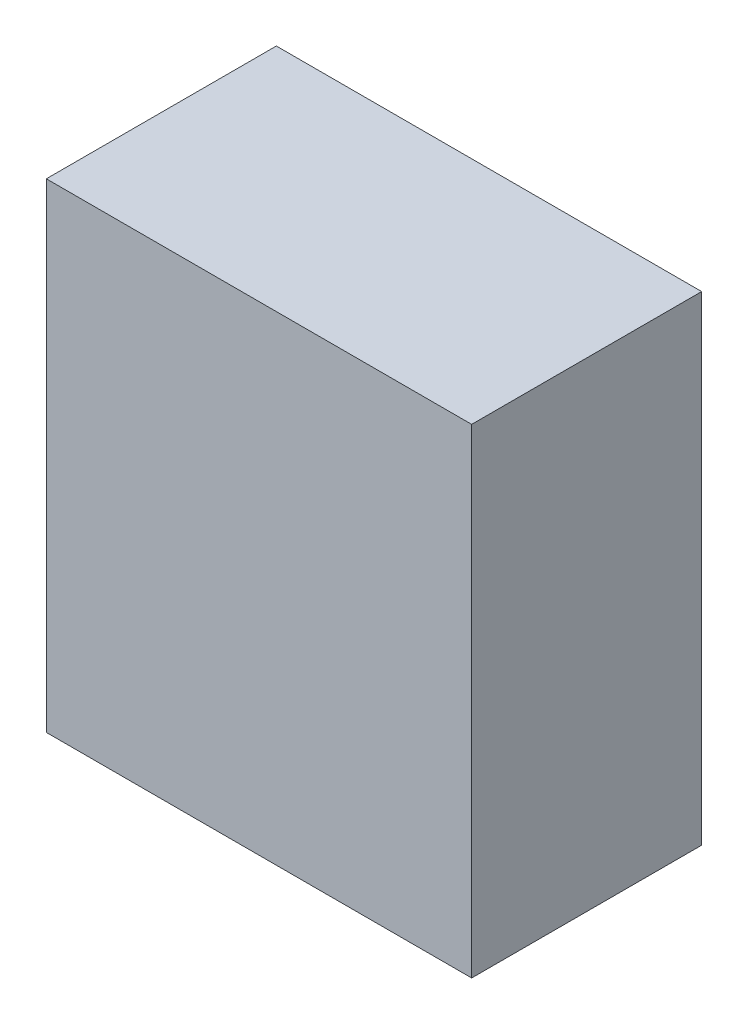
ISO-10303-21;
HEADER;
FILE_DESCRIPTION(('STEP AP214'),'2;1');
FILE_NAME('part.step','',(''),(''),'','','');
FILE_SCHEMA(('AUTOMOTIVE_DESIGN { 1 0 10303 214 1 1 1 1 }'));
ENDSEC;
DATA;
#1=APPLICATION_CONTEXT('core data for automotive mechanical design processes');
#2=APPLICATION_PROTOCOL_DEFINITION('international standard','automotive_design',2000,#1);
#3=PRODUCT_CONTEXT('',#1,'mechanical');
#4=PRODUCT('Part','Part','',(#3));
#5=PRODUCT_RELATED_PRODUCT_CATEGORY('part','',(#4));
#6=PRODUCT_DEFINITION_FORMATION('','',#4);
#7=PRODUCT_DEFINITION_CONTEXT('part definition',#1,'design');
#8=PRODUCT_DEFINITION('design','',#6,#7);
#9=PRODUCT_DEFINITION_SHAPE('','',#8);
#10=(LENGTH_UNIT() NAMED_UNIT(*) SI_UNIT(.MILLI.,.METRE.));
#11=(NAMED_UNIT(*) PLANE_ANGLE_UNIT() SI_UNIT($,.RADIAN.));
#12=(NAMED_UNIT(*) SI_UNIT($,.STERADIAN.) SOLID_ANGLE_UNIT());
#13=UNCERTAINTY_MEASURE_WITH_UNIT(LENGTH_MEASURE(1.E-05),#10,'distance_accuracy_value','');
#14=(GEOMETRIC_REPRESENTATION_CONTEXT(3) GLOBAL_UNCERTAINTY_ASSIGNED_CONTEXT((#13)) GLOBAL_UNIT_ASSIGNED_CONTEXT((#10,
#11,#12)) REPRESENTATION_CONTEXT('',''));
#15=CARTESIAN_POINT('',(0.,0.,0.));
#16=DIRECTION('',(0.,0.,1.));
#17=DIRECTION('',(1.,0.,0.));
#18=AXIS2_PLACEMENT_3D('',#15,#16,#17);
#19=CARTESIAN_POINT('',(0.,0.,-12.35));
#20=DIRECTION('',(0.,0.,-1.));
#21=DIRECTION('',(-1.,0.,0.));
#22=AXIS2_PLACEMENT_3D('',#19,#20,#21);
#23=PLANE('',#22);
#24=DIRECTION('',(0.,-1.,0.));
#25=VECTOR('',#24,1.);
#26=CARTESIAN_POINT('',(-155.366706922271,-14.9158190887617,-12.35));
#27=LINE('',#26,#25);
#28=CARTESIAN_POINT('',(-155.366706922271,7.5841809112383,-12.35));
#29=VERTEX_POINT('',#28);
#30=CARTESIAN_POINT('',(-155.366706922271,-14.9158190887617,-12.35));
#31=VERTEX_POINT('',#30);
#32=EDGE_CURVE('E40',#29,#31,#27,.T.);
#33=ORIENTED_EDGE('',*,*,#32,.F.);
#34=DIRECTION('',(1.,0.,0.));
#35=VECTOR('',#34,1.);
#36=CARTESIAN_POINT('',(-155.366706922271,7.5841809112383,-12.35));
#37=LINE('',#36,#35);
#38=CARTESIAN_POINT('',(-172.666706922271,7.5841809112383,-12.35));
#39=VERTEX_POINT('',#38);
#40=EDGE_CURVE('E145',#39,#29,#37,.T.);
#41=ORIENTED_EDGE('',*,*,#40,.F.);
#42=DIRECTION('',(0.,-1.,0.));
#43=VECTOR('',#42,1.);
#44=CARTESIAN_POINT('',(-172.666706922271,7.5841809112383,-12.35));
#45=LINE('',#44,#43);
#46=CARTESIAN_POINT('',(-172.666706922271,12.3341809112383,-12.35));
#47=VERTEX_POINT('',#46);
#48=EDGE_CURVE('E149',#47,#39,#45,.T.);
#49=ORIENTED_EDGE('',*,*,#48,.F.);
#50=DIRECTION('',(-1.,0.,0.));
#51=VECTOR('',#50,1.);
#52=CARTESIAN_POINT('',(-172.666706922271,12.3341809112383,-12.35));
#53=LINE('',#52,#51);
#54=CARTESIAN_POINT('',(-144.28057605004,12.3341809112383,-12.35));
#55=VERTEX_POINT('',#54);
#56=EDGE_CURVE('E107',#55,#47,#53,.T.);
#57=ORIENTED_EDGE('',*,*,#56,.F.);
#58=DIRECTION('',(0.,1.,0.));
#59=VECTOR('',#58,1.);
#60=CARTESIAN_POINT('',(-144.28057605004,12.3341809112383,-12.35));
#61=LINE('',#60,#59);
#62=CARTESIAN_POINT('',(-144.28057605004,-19.6658190887617,-12.35));
#63=VERTEX_POINT('',#62);
#64=EDGE_CURVE('E104',#63,#55,#61,.T.);
#65=ORIENTED_EDGE('',*,*,#64,.F.);
#66=DIRECTION('',(1.,0.,0.));
#67=VECTOR('',#66,1.);
#68=CARTESIAN_POINT('',(-144.28057605004,-19.6658190887617,-12.35));
#69=LINE('',#68,#67);
#70=CARTESIAN_POINT('',(-172.666706922271,-19.6658190887617,-12.35));
#71=VERTEX_POINT('',#70);
#72=EDGE_CURVE('E74',#71,#63,#69,.T.);
#73=ORIENTED_EDGE('',*,*,#72,.F.);
#74=DIRECTION('',(0.,-1.,0.));
#75=VECTOR('',#74,1.);
#76=CARTESIAN_POINT('',(-172.666706922271,-19.6658190887617,-12.35));
#77=LINE('',#76,#75);
#78=CARTESIAN_POINT('',(-172.666706922271,-14.9158190887617,-12.35));
#79=VERTEX_POINT('',#78);
#80=EDGE_CURVE('E79',#79,#71,#77,.T.);
#81=ORIENTED_EDGE('',*,*,#80,.F.);
#82=DIRECTION('',(-1.,0.,0.));
#83=VECTOR('',#82,1.);
#84=CARTESIAN_POINT('',(-172.666706922271,-14.9158190887617,-12.35));
#85=LINE('',#84,#83);
#86=EDGE_CURVE('E134',#31,#79,#85,.T.);
#87=ORIENTED_EDGE('',*,*,#86,.F.);
#88=EDGE_LOOP('',(#33,#41,#49,#57,#65,#73,#81,#87));
#89=FACE_BOUND('',#88,.T.);
#90=ADVANCED_FACE('F32',(#89),#23,.T.);
#91=CARTESIAN_POINT('',(-172.666706922271,-14.9158190887617,-55.1258392775111));
#92=DIRECTION('',(0.,1.,0.));
#93=DIRECTION('',(-1.,0.,0.));
#94=AXIS2_PLACEMENT_3D('',#91,#92,#93);
#95=PLANE('',#94);
#96=DIRECTION('',(0.,0.,1.));
#97=VECTOR('',#96,1.);
#98=CARTESIAN_POINT('',(-155.366706922271,-14.9158190887617,-55.1258392775111));
#99=LINE('',#98,#97);
#100=CARTESIAN_POINT('',(-155.366706922271,-14.9158190887617,0.));
#101=VERTEX_POINT('',#100);
#102=EDGE_CURVE('E11',#31,#101,#99,.T.);
#103=ORIENTED_EDGE('',*,*,#102,.F.);
#104=ORIENTED_EDGE('',*,*,#86,.T.);
#105=DIRECTION('',(0.,0.,1.));
#106=VECTOR('',#105,1.);
#107=CARTESIAN_POINT('',(-172.666706922271,-14.9158190887617,-55.1258392775111));
#108=LINE('',#107,#106);
#109=CARTESIAN_POINT('',(-172.666706922271,-14.9158190887617,0.));
#110=VERTEX_POINT('',#109);
#111=EDGE_CURVE('E142',#79,#110,#108,.T.);
#112=ORIENTED_EDGE('',*,*,#111,.T.);
#113=DIRECTION('',(-1.,0.,0.));
#114=VECTOR('',#113,1.);
#115=CARTESIAN_POINT('',(-172.666706922271,-14.9158190887617,0.));
#116=LINE('',#115,#114);
#117=EDGE_CURVE('E135',#101,#110,#116,.T.);
#118=ORIENTED_EDGE('',*,*,#117,.F.);
#119=EDGE_LOOP('',(#103,#104,#112,#118));
#120=FACE_BOUND('',#119,.T.);
#121=ADVANCED_FACE('F165',(#120),#95,.T.);
#122=CARTESIAN_POINT('',(-172.666706922271,-19.6658190887617,-55.1258392775111));
#123=DIRECTION('',(-1.,0.,0.));
#124=DIRECTION('',(0.,0.,1.));
#125=AXIS2_PLACEMENT_3D('',#122,#123,#124);
#126=PLANE('',#125);
#127=ORIENTED_EDGE('',*,*,#111,.F.);
#128=ORIENTED_EDGE('',*,*,#80,.T.);
#129=DIRECTION('',(0.,0.,1.));
#130=VECTOR('',#129,1.);
#131=CARTESIAN_POINT('',(-172.666706922271,-19.6658190887617,-55.1258392775111));
#132=LINE('',#131,#130);
#133=CARTESIAN_POINT('',(-172.666706922271,-19.6658190887617,3.));
#134=VERTEX_POINT('',#133);
#135=EDGE_CURVE('E156',#71,#134,#132,.T.);
#136=ORIENTED_EDGE('',*,*,#135,.T.);
#137=DIRECTION('',(0.,-1.,0.));
#138=VECTOR('',#137,1.);
#139=CARTESIAN_POINT('',(-172.666706922271,-19.6658190887617,3.));
#140=LINE('',#139,#138);
#141=CARTESIAN_POINT('',(-172.666706922271,12.3341809112383,3.));
#142=VERTEX_POINT('',#141);
#143=EDGE_CURVE('E117',#142,#134,#140,.T.);
#144=ORIENTED_EDGE('',*,*,#143,.F.);
#145=DIRECTION('',(0.,0.,1.));
#146=VECTOR('',#145,1.);
#147=CARTESIAN_POINT('',(-172.666706922271,12.3341809112383,-55.1258392775111));
#148=LINE('',#147,#146);
#149=EDGE_CURVE('E113',#47,#142,#148,.T.);
#150=ORIENTED_EDGE('',*,*,#149,.F.);
#151=ORIENTED_EDGE('',*,*,#48,.T.);
#152=DIRECTION('',(0.,0.,1.));
#153=VECTOR('',#152,1.);
#154=CARTESIAN_POINT('',(-172.666706922271,7.5841809112383,-55.1258392775111));
#155=LINE('',#154,#153);
#156=CARTESIAN_POINT('',(-172.666706922271,7.5841809112383,0.));
#157=VERTEX_POINT('',#156);
#158=EDGE_CURVE('E148',#39,#157,#155,.T.);
#159=ORIENTED_EDGE('',*,*,#158,.T.);
#160=DIRECTION('',(0.,-1.,0.));
#161=VECTOR('',#160,1.);
#162=CARTESIAN_POINT('',(-172.666706922271,-19.6658190887617,0.));
#163=LINE('',#162,#161);
#164=EDGE_CURVE('E123',#157,#110,#163,.T.);
#165=ORIENTED_EDGE('',*,*,#164,.T.);
#166=EDGE_LOOP('',(#127,#128,#136,#144,#150,#151,#159,#165));
#167=FACE_BOUND('',#166,.T.);
#168=ADVANCED_FACE('F170',(#167),#126,.T.);
#169=CARTESIAN_POINT('',(-144.28057605004,-19.6658190887617,-55.1258392775111));
#170=DIRECTION('',(0.,-1.,0.));
#171=DIRECTION('',(1.,0.,0.));
#172=AXIS2_PLACEMENT_3D('',#169,#170,#171);
#173=PLANE('',#172);
#174=ORIENTED_EDGE('',*,*,#135,.F.);
#175=ORIENTED_EDGE('',*,*,#72,.T.);
#176=DIRECTION('',(0.,0.,1.));
#177=VECTOR('',#176,1.);
#178=CARTESIAN_POINT('',(-144.28057605004,-19.6658190887617,-55.1258392775111));
#179=LINE('',#178,#177);
#180=CARTESIAN_POINT('',(-144.28057605004,-19.6658190887617,3.));
#181=VERTEX_POINT('',#180);
#182=EDGE_CURVE('E154',#63,#181,#179,.T.);
#183=ORIENTED_EDGE('',*,*,#182,.T.);
#184=DIRECTION('',(1.,0.,0.));
#185=VECTOR('',#184,1.);
#186=CARTESIAN_POINT('',(-144.28057605004,-19.6658190887617,3.));
#187=LINE('',#186,#185);
#188=EDGE_CURVE('E122',#134,#181,#187,.T.);
#189=ORIENTED_EDGE('',*,*,#188,.F.);
#190=EDGE_LOOP('',(#174,#175,#183,#189));
#191=FACE_BOUND('',#190,.T.);
#192=ADVANCED_FACE('F178',(#191),#173,.T.);
#193=CARTESIAN_POINT('',(-144.28057605004,12.3341809112383,-55.1258392775111));
#194=DIRECTION('',(1.,0.,0.));
#195=DIRECTION('',(0.,0.,-1.));
#196=AXIS2_PLACEMENT_3D('',#193,#194,#195);
#197=PLANE('',#196);
#198=ORIENTED_EDGE('',*,*,#182,.F.);
#199=ORIENTED_EDGE('',*,*,#64,.T.);
#200=DIRECTION('',(0.,0.,1.));
#201=VECTOR('',#200,1.);
#202=CARTESIAN_POINT('',(-144.28057605004,12.3341809112383,-55.1258392775111));
#203=LINE('',#202,#201);
#204=CARTESIAN_POINT('',(-144.28057605004,12.3341809112383,3.));
#205=VERTEX_POINT('',#204);
#206=EDGE_CURVE('E98',#55,#205,#203,.T.);
#207=ORIENTED_EDGE('',*,*,#206,.T.);
#208=DIRECTION('',(0.,1.,0.));
#209=VECTOR('',#208,1.);
#210=CARTESIAN_POINT('',(-144.28057605004,-19.6658190887617,3.));
#211=LINE('',#210,#209);
#212=EDGE_CURVE('E103',#181,#205,#211,.T.);
#213=ORIENTED_EDGE('',*,*,#212,.F.);
#214=EDGE_LOOP('',(#198,#199,#207,#213));
#215=FACE_BOUND('',#214,.T.);
#216=ADVANCED_FACE('F101',(#215),#197,.T.);
#217=CARTESIAN_POINT('',(-172.666706922271,12.3341809112383,-55.1258392775111));
#218=DIRECTION('',(0.,1.,0.));
#219=DIRECTION('',(0.,0.,1.));
#220=AXIS2_PLACEMENT_3D('',#217,#218,#219);
#221=PLANE('',#220);
#222=ORIENTED_EDGE('',*,*,#206,.F.);
#223=ORIENTED_EDGE('',*,*,#56,.T.);
#224=ORIENTED_EDGE('',*,*,#149,.T.);
#225=DIRECTION('',(-1.,0.,0.));
#226=VECTOR('',#225,1.);
#227=CARTESIAN_POINT('',(-144.28057605004,12.3341809112383,3.));
#228=LINE('',#227,#226);
#229=EDGE_CURVE('E110',#205,#142,#228,.T.);
#230=ORIENTED_EDGE('',*,*,#229,.F.);
#231=EDGE_LOOP('',(#222,#223,#224,#230));
#232=FACE_BOUND('',#231,.T.);
#233=ADVANCED_FACE('F111',(#232),#221,.T.);
#234=CARTESIAN_POINT('',(-155.366706922271,7.5841809112383,-55.1258392775111));
#235=DIRECTION('',(0.,-1.,0.));
#236=DIRECTION('',(0.,0.,-1.));
#237=AXIS2_PLACEMENT_3D('',#234,#235,#236);
#238=PLANE('',#237);
#239=ORIENTED_EDGE('',*,*,#158,.F.);
#240=ORIENTED_EDGE('',*,*,#40,.T.);
#241=DIRECTION('',(0.,0.,1.));
#242=VECTOR('',#241,1.);
#243=CARTESIAN_POINT('',(-155.366706922271,7.5841809112383,-55.1258392775111));
#244=LINE('',#243,#242);
#245=CARTESIAN_POINT('',(-155.366706922271,7.5841809112383,0.));
#246=VERTEX_POINT('',#245);
#247=EDGE_CURVE('E144',#29,#246,#244,.T.);
#248=ORIENTED_EDGE('',*,*,#247,.T.);
#249=DIRECTION('',(1.,0.,0.));
#250=VECTOR('',#249,1.);
#251=CARTESIAN_POINT('',(-155.366706922271,7.5841809112383,0.));
#252=LINE('',#251,#250);
#253=EDGE_CURVE('E131',#157,#246,#252,.T.);
#254=ORIENTED_EDGE('',*,*,#253,.F.);
#255=EDGE_LOOP('',(#239,#240,#248,#254));
#256=FACE_BOUND('',#255,.T.);
#257=ADVANCED_FACE('F174',(#256),#238,.T.);
#258=CARTESIAN_POINT('',(-155.366706922271,-14.9158190887617,-55.1258392775111));
#259=DIRECTION('',(-1.,0.,0.));
#260=DIRECTION('',(0.,0.,1.));
#261=AXIS2_PLACEMENT_3D('',#258,#259,#260);
#262=PLANE('',#261);
#263=ORIENTED_EDGE('',*,*,#247,.F.);
#264=ORIENTED_EDGE('',*,*,#32,.T.);
#265=ORIENTED_EDGE('',*,*,#102,.T.);
#266=DIRECTION('',(0.,-1.,0.));
#267=VECTOR('',#266,1.);
#268=CARTESIAN_POINT('',(-155.366706922271,-14.9158190887617,0.));
#269=LINE('',#268,#267);
#270=EDGE_CURVE('E129',#246,#101,#269,.T.);
#271=ORIENTED_EDGE('',*,*,#270,.F.);
#272=EDGE_LOOP('',(#263,#264,#265,#271));
#273=FACE_BOUND('',#272,.T.);
#274=ADVANCED_FACE('F176',(#273),#262,.T.);
#275=CARTESIAN_POINT('',(0.,0.,0.));
#276=DIRECTION('',(0.,0.,1.));
#277=DIRECTION('',(1.,0.,0.));
#278=AXIS2_PLACEMENT_3D('',#275,#276,#277);
#279=PLANE('',#278);
#280=ORIENTED_EDGE('',*,*,#270,.T.);
#281=ORIENTED_EDGE('',*,*,#117,.T.);
#282=ORIENTED_EDGE('',*,*,#164,.F.);
#283=ORIENTED_EDGE('',*,*,#253,.T.);
#284=EDGE_LOOP('',(#280,#281,#282,#283));
#285=FACE_BOUND('',#284,.T.);
#286=ADVANCED_FACE('F169',(#285),#279,.F.);
#287=CARTESIAN_POINT('',(0.,0.,3.));
#288=DIRECTION('',(0.,0.,1.));
#289=DIRECTION('',(1.,0.,0.));
#290=AXIS2_PLACEMENT_3D('',#287,#288,#289);
#291=PLANE('',#290);
#292=ORIENTED_EDGE('',*,*,#212,.T.);
#293=ORIENTED_EDGE('',*,*,#229,.T.);
#294=ORIENTED_EDGE('',*,*,#143,.T.);
#295=ORIENTED_EDGE('',*,*,#188,.T.);
#296=EDGE_LOOP('',(#292,#293,#294,#295));
#297=FACE_BOUND('',#296,.T.);
#298=ADVANCED_FACE('F120',(#297),#291,.T.);
#299=CLOSED_SHELL('',(#90,#121,#168,#192,#216,#233,#257,#274,#286,#298));
#300=MANIFOLD_SOLID_BREP('B2',#299);
#301=ADVANCED_BREP_SHAPE_REPRESENTATION('',(#18,#300),#14);
#302=SHAPE_DEFINITION_REPRESENTATION(#9,#301);
ENDSEC;
END-ISO-10303-21;
